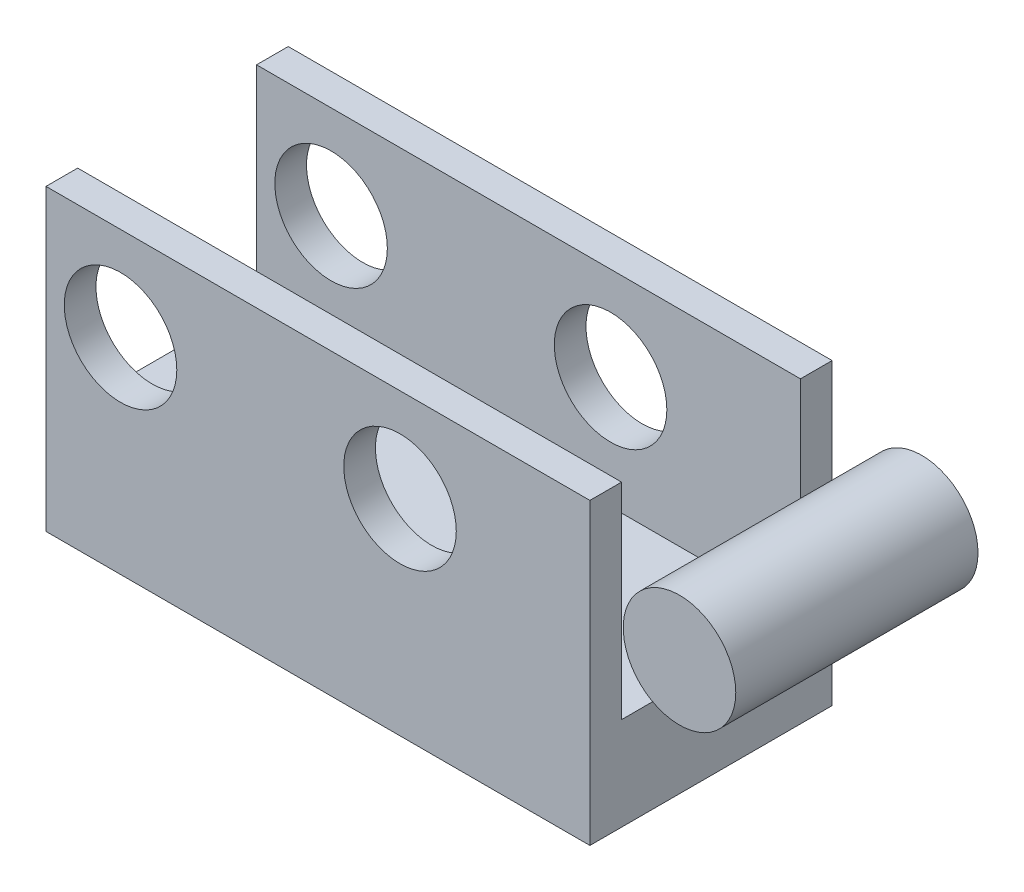
ISO-10303-21;
HEADER;
FILE_DESCRIPTION(('STEP AP214'),'2;1');
FILE_NAME('part.step','',(''),(''),'','','');
FILE_SCHEMA(('AUTOMOTIVE_DESIGN { 1 0 10303 214 1 1 1 1 }'));
ENDSEC;
DATA;
#1=APPLICATION_CONTEXT('core data for automotive mechanical design processes');
#2=APPLICATION_PROTOCOL_DEFINITION('international standard','automotive_design',2000,#1);
#3=PRODUCT_CONTEXT('',#1,'mechanical');
#4=PRODUCT('Part','Part','',(#3));
#5=PRODUCT_RELATED_PRODUCT_CATEGORY('part','',(#4));
#6=PRODUCT_DEFINITION_FORMATION('','',#4);
#7=PRODUCT_DEFINITION_CONTEXT('part definition',#1,'design');
#8=PRODUCT_DEFINITION('design','',#6,#7);
#9=PRODUCT_DEFINITION_SHAPE('','',#8);
#10=(LENGTH_UNIT() NAMED_UNIT(*) SI_UNIT(.MILLI.,.METRE.));
#11=(NAMED_UNIT(*) PLANE_ANGLE_UNIT() SI_UNIT($,.RADIAN.));
#12=(NAMED_UNIT(*) SI_UNIT($,.STERADIAN.) SOLID_ANGLE_UNIT());
#13=UNCERTAINTY_MEASURE_WITH_UNIT(LENGTH_MEASURE(1.E-05),#10,'distance_accuracy_value','');
#14=(GEOMETRIC_REPRESENTATION_CONTEXT(3) GLOBAL_UNCERTAINTY_ASSIGNED_CONTEXT((#13)) GLOBAL_UNIT_ASSIGNED_CONTEXT((#10,
#11,#12)) REPRESENTATION_CONTEXT('',''));
#15=CARTESIAN_POINT('',(0.,0.,0.));
#16=DIRECTION('',(0.,0.,1.));
#17=DIRECTION('',(1.,0.,0.));
#18=AXIS2_PLACEMENT_3D('',#15,#16,#17);
#19=CARTESIAN_POINT('',(9.70218830460323,-2.14074725353277,3.25));
#20=DIRECTION('',(0.,0.,-1.));
#21=DIRECTION('',(-1.,0.,0.));
#22=AXIS2_PLACEMENT_3D('',#19,#20,#21);
#23=CYLINDRICAL_SURFACE('',#22,1.50999999999898);
#24=CARTESIAN_POINT('',(9.70218830460323,-2.14074725353277,3.25));
#25=DIRECTION('',(0.,0.,1.));
#26=DIRECTION('',(1.,0.,0.));
#27=AXIS2_PLACEMENT_3D('',#24,#25,#26);
#28=CIRCLE('',#27,1.50999999999898);
#29=CARTESIAN_POINT('',(11.2121883046022,-2.14074725353277,3.25));
#30=VERTEX_POINT('',#29);
#31=EDGE_CURVE('E11',#30,#30,#28,.T.);
#32=ORIENTED_EDGE('',*,*,#31,.F.);
#33=EDGE_LOOP('',(#32));
#34=FACE_BOUND('',#33,.T.);
#35=CARTESIAN_POINT('',(9.70218830460323,-2.14074725353277,-3.25));
#36=DIRECTION('',(0.,0.,1.));
#37=DIRECTION('',(1.,0.,0.));
#38=AXIS2_PLACEMENT_3D('',#35,#36,#37);
#39=CIRCLE('',#38,1.50999999999898);
#40=CARTESIAN_POINT('',(11.2121883046022,-2.14074725353277,-3.25));
#41=VERTEX_POINT('',#40);
#42=EDGE_CURVE('E48',#41,#41,#39,.T.);
#43=ORIENTED_EDGE('',*,*,#42,.T.);
#44=EDGE_LOOP('',(#43));
#45=FACE_BOUND('',#44,.T.);
#46=ADVANCED_FACE('F45',(#34,#45),#23,.T.);
#47=CARTESIAN_POINT('',(9.70218830460323,-2.14074725353277,3.25));
#48=DIRECTION('',(0.,0.,1.));
#49=DIRECTION('',(1.,0.,0.));
#50=AXIS2_PLACEMENT_3D('',#47,#48,#49);
#51=PLANE('',#50);
#52=ORIENTED_EDGE('',*,*,#31,.T.);
#53=EDGE_LOOP('',(#52));
#54=FACE_BOUND('',#53,.T.);
#55=ADVANCED_FACE('F60',(#54),#51,.T.);
#56=CARTESIAN_POINT('',(9.70218830460323,-2.14074725353277,-3.25));
#57=DIRECTION('',(0.,0.,1.));
#58=DIRECTION('',(1.,0.,0.));
#59=AXIS2_PLACEMENT_3D('',#56,#57,#58);
#60=PLANE('',#59);
#61=ORIENTED_EDGE('',*,*,#42,.F.);
#62=EDGE_LOOP('',(#61));
#63=FACE_BOUND('',#62,.T.);
#64=ADVANCED_FACE('F58',(#63),#60,.F.);
#65=CLOSED_SHELL('',(#46,#55,#64));
#66=MANIFOLD_SOLID_BREP('B2',#65);
#67=CARTESIAN_POINT('',(-7.29781169539677,0.369252746467232,3.25));
#68=DIRECTION('',(1.,0.,0.));
#69=DIRECTION('',(0.,1.,0.));
#70=AXIS2_PLACEMENT_3D('',#67,#68,#69);
#71=PLANE('',#70);
#72=DIRECTION('',(0.,-1.,0.));
#73=VECTOR('',#72,1.);
#74=CARTESIAN_POINT('',(-7.29781169539677,0.369252746467232,-2.4));
#75=LINE('',#74,#73);
#76=CARTESIAN_POINT('',(-7.29781169539677,0.369252746467232,-2.4));
#77=VERTEX_POINT('',#76);
#78=CARTESIAN_POINT('',(-7.29781169539677,-5.15074725353277,-2.4));
#79=VERTEX_POINT('',#78);
#80=EDGE_CURVE('E173',#77,#79,#75,.T.);
#81=ORIENTED_EDGE('',*,*,#80,.F.);
#82=DIRECTION('',(0.,0.,-1.));
#83=VECTOR('',#82,1.);
#84=CARTESIAN_POINT('',(-7.29781169539677,0.369252746467232,3.25));
#85=LINE('',#84,#83);
#86=CARTESIAN_POINT('',(-7.29781169539677,0.369252746467232,-3.25));
#87=VERTEX_POINT('',#86);
#88=EDGE_CURVE('E133',#77,#87,#85,.T.);
#89=ORIENTED_EDGE('',*,*,#88,.T.);
#90=DIRECTION('',(0.,-1.,0.));
#91=VECTOR('',#90,1.);
#92=CARTESIAN_POINT('',(-7.29781169539677,0.369252746467232,-3.25));
#93=LINE('',#92,#91);
#94=CARTESIAN_POINT('',(-7.29781169539677,-7.65074725353277,-3.25));
#95=VERTEX_POINT('',#94);
#96=EDGE_CURVE('E203',#87,#95,#93,.T.);
#97=ORIENTED_EDGE('',*,*,#96,.T.);
#98=DIRECTION('',(0.,0.,-1.));
#99=VECTOR('',#98,1.);
#100=CARTESIAN_POINT('',(-7.29781169539677,-7.65074725353277,3.25));
#101=LINE('',#100,#99);
#102=CARTESIAN_POINT('',(-7.29781169539677,-7.65074725353277,3.25));
#103=VERTEX_POINT('',#102);
#104=EDGE_CURVE('E43',#103,#95,#101,.T.);
#105=ORIENTED_EDGE('',*,*,#104,.F.);
#106=DIRECTION('',(0.,-1.,0.));
#107=VECTOR('',#106,1.);
#108=CARTESIAN_POINT('',(-7.29781169539677,0.369252746467232,3.25));
#109=LINE('',#108,#107);
#110=CARTESIAN_POINT('',(-7.29781169539677,0.369252746467232,3.25));
#111=VERTEX_POINT('',#110);
#112=EDGE_CURVE('E206',#111,#103,#109,.T.);
#113=ORIENTED_EDGE('',*,*,#112,.F.);
#114=CARTESIAN_POINT('',(-7.29781169539677,0.369252746467232,2.4));
#115=VERTEX_POINT('',#114);
#116=EDGE_CURVE('E220',#111,#115,#85,.T.);
#117=ORIENTED_EDGE('',*,*,#116,.T.);
#118=DIRECTION('',(0.,-1.,0.));
#119=VECTOR('',#118,1.);
#120=CARTESIAN_POINT('',(-7.29781169539677,0.369252746467232,2.4));
#121=LINE('',#120,#119);
#122=CARTESIAN_POINT('',(-7.29781169539677,-5.15074725353277,2.4));
#123=VERTEX_POINT('',#122);
#124=EDGE_CURVE('E102',#115,#123,#121,.T.);
#125=ORIENTED_EDGE('',*,*,#124,.T.);
#126=DIRECTION('',(0.,0.,1.));
#127=VECTOR('',#126,1.);
#128=CARTESIAN_POINT('',(-7.29781169539677,-5.15074725353277,-2.4));
#129=LINE('',#128,#127);
#130=EDGE_CURVE('E167',#79,#123,#129,.T.);
#131=ORIENTED_EDGE('',*,*,#130,.F.);
#132=EDGE_LOOP('',(#81,#89,#97,#105,#113,#117,#125,#131));
#133=FACE_BOUND('',#132,.T.);
#134=ADVANCED_FACE('F86',(#133),#71,.F.);
#135=CARTESIAN_POINT('',(7.29781169539677,0.369252746467232,3.25));
#136=DIRECTION('',(-1.,0.,0.));
#137=DIRECTION('',(0.,-1.,0.));
#138=AXIS2_PLACEMENT_3D('',#135,#136,#137);
#139=PLANE('',#138);
#140=DIRECTION('',(0.,1.,0.));
#141=VECTOR('',#140,1.);
#142=CARTESIAN_POINT('',(7.29781169539677,0.369252746467232,-2.4));
#143=LINE('',#142,#141);
#144=CARTESIAN_POINT('',(7.29781169539677,-5.15074725353277,-2.4));
#145=VERTEX_POINT('',#144);
#146=CARTESIAN_POINT('',(7.29781169539677,0.369252746467232,-2.4));
#147=VERTEX_POINT('',#146);
#148=EDGE_CURVE('E172',#145,#147,#143,.T.);
#149=ORIENTED_EDGE('',*,*,#148,.F.);
#150=DIRECTION('',(0.,0.,1.));
#151=VECTOR('',#150,1.);
#152=CARTESIAN_POINT('',(7.29781169539677,-5.15074725353277,-2.4));
#153=LINE('',#152,#151);
#154=CARTESIAN_POINT('',(7.29781169539677,-5.15074725353277,2.4));
#155=VERTEX_POINT('',#154);
#156=EDGE_CURVE('E169',#145,#155,#153,.T.);
#157=ORIENTED_EDGE('',*,*,#156,.T.);
#158=DIRECTION('',(0.,1.,0.));
#159=VECTOR('',#158,1.);
#160=CARTESIAN_POINT('',(7.29781169539677,0.369252746467232,2.4));
#161=LINE('',#160,#159);
#162=CARTESIAN_POINT('',(7.29781169539677,0.369252746467232,2.4));
#163=VERTEX_POINT('',#162);
#164=EDGE_CURVE('E289',#155,#163,#161,.T.);
#165=ORIENTED_EDGE('',*,*,#164,.T.);
#166=DIRECTION('',(0.,0.,-1.));
#167=VECTOR('',#166,1.);
#168=CARTESIAN_POINT('',(7.29781169539677,0.369252746467232,3.25));
#169=LINE('',#168,#167);
#170=CARTESIAN_POINT('',(7.29781169539677,0.369252746467232,3.25));
#171=VERTEX_POINT('',#170);
#172=EDGE_CURVE('E223',#171,#163,#169,.T.);
#173=ORIENTED_EDGE('',*,*,#172,.F.);
#174=DIRECTION('',(0.,1.,0.));
#175=VECTOR('',#174,1.);
#176=CARTESIAN_POINT('',(7.29781169539677,0.369252746467232,3.25));
#177=LINE('',#176,#175);
#178=CARTESIAN_POINT('',(7.29781169539677,-7.65074725353277,3.25));
#179=VERTEX_POINT('',#178);
#180=EDGE_CURVE('E210',#179,#171,#177,.T.);
#181=ORIENTED_EDGE('',*,*,#180,.F.);
#182=DIRECTION('',(0.,0.,-1.));
#183=VECTOR('',#182,1.);
#184=CARTESIAN_POINT('',(7.29781169539677,-7.65074725353277,3.25));
#185=LINE('',#184,#183);
#186=CARTESIAN_POINT('',(7.29781169539677,-7.65074725353277,-3.25));
#187=VERTEX_POINT('',#186);
#188=EDGE_CURVE('E94',#179,#187,#185,.T.);
#189=ORIENTED_EDGE('',*,*,#188,.T.);
#190=DIRECTION('',(0.,1.,0.));
#191=VECTOR('',#190,1.);
#192=CARTESIAN_POINT('',(7.29781169539677,0.369252746467232,-3.25));
#193=LINE('',#192,#191);
#194=CARTESIAN_POINT('',(7.29781169539677,0.369252746467232,-3.25));
#195=VERTEX_POINT('',#194);
#196=EDGE_CURVE('E216',#187,#195,#193,.T.);
#197=ORIENTED_EDGE('',*,*,#196,.T.);
#198=EDGE_CURVE('E222',#147,#195,#169,.T.);
#199=ORIENTED_EDGE('',*,*,#198,.F.);
#200=EDGE_LOOP('',(#149,#157,#165,#173,#181,#189,#197,#199));
#201=FACE_BOUND('',#200,.T.);
#202=ADVANCED_FACE('F257',(#201),#139,.F.);
#203=CARTESIAN_POINT('',(-7.29781169539677,0.369252746467232,3.25));
#204=DIRECTION('',(0.,-1.,0.));
#205=DIRECTION('',(0.,0.,-1.));
#206=AXIS2_PLACEMENT_3D('',#203,#204,#205);
#207=PLANE('',#206);
#208=DIRECTION('',(-1.,0.,0.));
#209=VECTOR('',#208,1.);
#210=CARTESIAN_POINT('',(-7.29781169539677,0.369252746467232,-2.4));
#211=LINE('',#210,#209);
#212=EDGE_CURVE('E177',#147,#77,#211,.T.);
#213=ORIENTED_EDGE('',*,*,#212,.F.);
#214=ORIENTED_EDGE('',*,*,#198,.T.);
#215=DIRECTION('',(-1.,0.,0.));
#216=VECTOR('',#215,1.);
#217=CARTESIAN_POINT('',(-7.29781169539677,0.369252746467232,-3.25));
#218=LINE('',#217,#216);
#219=EDGE_CURVE('E208',#195,#87,#218,.T.);
#220=ORIENTED_EDGE('',*,*,#219,.T.);
#221=ORIENTED_EDGE('',*,*,#88,.F.);
#222=EDGE_LOOP('',(#213,#214,#220,#221));
#223=FACE_BOUND('',#222,.T.);
#224=ADVANCED_FACE('F261',(#223),#207,.F.);
#225=CARTESIAN_POINT('',(2.20218830460323,-2.14074725353277,3.25));
#226=DIRECTION('',(0.,0.,-1.));
#227=DIRECTION('',(-1.,0.,0.));
#228=AXIS2_PLACEMENT_3D('',#225,#226,#227);
#229=CYLINDRICAL_SURFACE('',#228,1.50999999999898);
#230=CARTESIAN_POINT('',(2.20218830460323,-2.14074725353277,-3.25));
#231=DIRECTION('',(0.,0.,1.));
#232=DIRECTION('',(1.,0.,0.));
#233=AXIS2_PLACEMENT_3D('',#230,#231,#232);
#234=CIRCLE('',#233,1.50999999999898);
#235=CARTESIAN_POINT('',(3.71218830460221,-2.14074725353277,-3.25));
#236=VERTEX_POINT('',#235);
#237=EDGE_CURVE('E197',#236,#236,#234,.T.);
#238=ORIENTED_EDGE('',*,*,#237,.F.);
#239=EDGE_LOOP('',(#238));
#240=FACE_BOUND('',#239,.T.);
#241=CARTESIAN_POINT('',(2.20218830460323,-2.14074725353277,-2.4));
#242=DIRECTION('',(0.,0.,1.));
#243=DIRECTION('',(1.,0.,0.));
#244=AXIS2_PLACEMENT_3D('',#241,#242,#243);
#245=CIRCLE('',#244,1.50999999999898);
#246=CARTESIAN_POINT('',(3.71218830460221,-2.14074725353277,-2.4));
#247=VERTEX_POINT('',#246);
#248=EDGE_CURVE('E190',#247,#247,#245,.T.);
#249=ORIENTED_EDGE('',*,*,#248,.T.);
#250=EDGE_LOOP('',(#249));
#251=FACE_BOUND('',#250,.T.);
#252=ADVANCED_FACE('F252',(#240,#251),#229,.F.);
#253=CARTESIAN_POINT('',(-5.29781169539677,-2.14074725353277,3.25));
#254=DIRECTION('',(0.,0.,-1.));
#255=DIRECTION('',(-1.,0.,0.));
#256=AXIS2_PLACEMENT_3D('',#253,#254,#255);
#257=CYLINDRICAL_SURFACE('',#256,1.50999999999898);
#258=CARTESIAN_POINT('',(-5.29781169539677,-2.14074725353277,-3.25));
#259=DIRECTION('',(0.,0.,1.));
#260=DIRECTION('',(1.,0.,0.));
#261=AXIS2_PLACEMENT_3D('',#258,#259,#260);
#262=CIRCLE('',#261,1.50999999999898);
#263=CARTESIAN_POINT('',(-3.78781169539779,-2.14074725353277,-3.25));
#264=VERTEX_POINT('',#263);
#265=EDGE_CURVE('E193',#264,#264,#262,.T.);
#266=ORIENTED_EDGE('',*,*,#265,.F.);
#267=EDGE_LOOP('',(#266));
#268=FACE_BOUND('',#267,.T.);
#269=CARTESIAN_POINT('',(-5.29781169539677,-2.14074725353277,-2.4));
#270=DIRECTION('',(0.,0.,1.));
#271=DIRECTION('',(1.,0.,0.));
#272=AXIS2_PLACEMENT_3D('',#269,#270,#271);
#273=CIRCLE('',#272,1.50999999999898);
#274=CARTESIAN_POINT('',(-3.78781169539779,-2.14074725353277,-2.4));
#275=VERTEX_POINT('',#274);
#276=EDGE_CURVE('E89',#275,#275,#273,.T.);
#277=ORIENTED_EDGE('',*,*,#276,.T.);
#278=EDGE_LOOP('',(#277));
#279=FACE_BOUND('',#278,.T.);
#280=ADVANCED_FACE('F237',(#268,#279),#257,.F.);
#281=CARTESIAN_POINT('',(0.,0.,3.25));
#282=DIRECTION('',(0.,0.,1.));
#283=DIRECTION('',(1.,0.,0.));
#284=AXIS2_PLACEMENT_3D('',#281,#282,#283);
#285=PLANE('',#284);
#286=CARTESIAN_POINT('',(2.20218830460323,-2.14074725353277,3.25));
#287=DIRECTION('',(0.,0.,1.));
#288=DIRECTION('',(1.,0.,0.));
#289=AXIS2_PLACEMENT_3D('',#286,#287,#288);
#290=CIRCLE('',#289,1.50999999999898);
#291=CARTESIAN_POINT('',(3.71218830460221,-2.14074725353277,3.25));
#292=VERTEX_POINT('',#291);
#293=EDGE_CURVE('E200',#292,#292,#290,.T.);
#294=ORIENTED_EDGE('',*,*,#293,.F.);
#295=EDGE_LOOP('',(#294));
#296=FACE_BOUND('',#295,.T.);
#297=ORIENTED_EDGE('',*,*,#112,.T.);
#298=DIRECTION('',(1.,0.,0.));
#299=VECTOR('',#298,1.);
#300=CARTESIAN_POINT('',(-7.29781169539677,-7.65074725353277,3.25));
#301=LINE('',#300,#299);
#302=EDGE_CURVE('E140',#103,#179,#301,.T.);
#303=ORIENTED_EDGE('',*,*,#302,.T.);
#304=ORIENTED_EDGE('',*,*,#180,.T.);
#305=DIRECTION('',(-1.,0.,0.));
#306=VECTOR('',#305,1.);
#307=CARTESIAN_POINT('',(-7.29781169539677,0.369252746467232,3.25));
#308=LINE('',#307,#306);
#309=EDGE_CURVE('E111',#171,#111,#308,.T.);
#310=ORIENTED_EDGE('',*,*,#309,.T.);
#311=EDGE_LOOP('',(#297,#303,#304,#310));
#312=FACE_BOUND('',#311,.T.);
#313=CARTESIAN_POINT('',(-5.29781169539677,-2.14074725353277,3.25));
#314=DIRECTION('',(0.,0.,1.));
#315=DIRECTION('',(1.,0.,0.));
#316=AXIS2_PLACEMENT_3D('',#313,#314,#315);
#317=CIRCLE('',#316,1.50999999999898);
#318=CARTESIAN_POINT('',(-3.78781169539779,-2.14074725353277,3.25));
#319=VERTEX_POINT('',#318);
#320=EDGE_CURVE('E194',#319,#319,#317,.T.);
#321=ORIENTED_EDGE('',*,*,#320,.F.);
#322=EDGE_LOOP('',(#321));
#323=FACE_BOUND('',#322,.T.);
#324=ADVANCED_FACE('F240',(#296,#312,#323),#285,.T.);
#325=CARTESIAN_POINT('',(0.,0.,-3.25));
#326=DIRECTION('',(0.,0.,1.));
#327=DIRECTION('',(1.,0.,0.));
#328=AXIS2_PLACEMENT_3D('',#325,#326,#327);
#329=PLANE('',#328);
#330=ORIENTED_EDGE('',*,*,#96,.F.);
#331=ORIENTED_EDGE('',*,*,#219,.F.);
#332=ORIENTED_EDGE('',*,*,#196,.F.);
#333=DIRECTION('',(1.,0.,0.));
#334=VECTOR('',#333,1.);
#335=CARTESIAN_POINT('',(-7.29781169539677,-7.65074725353277,-3.25));
#336=LINE('',#335,#334);
#337=EDGE_CURVE('E214',#95,#187,#336,.T.);
#338=ORIENTED_EDGE('',*,*,#337,.F.);
#339=EDGE_LOOP('',(#330,#331,#332,#338));
#340=FACE_BOUND('',#339,.T.);
#341=ORIENTED_EDGE('',*,*,#237,.T.);
#342=EDGE_LOOP('',(#341));
#343=FACE_BOUND('',#342,.T.);
#344=ORIENTED_EDGE('',*,*,#265,.T.);
#345=EDGE_LOOP('',(#344));
#346=FACE_BOUND('',#345,.T.);
#347=ADVANCED_FACE('F242',(#340,#343,#346),#329,.F.);
#348=CARTESIAN_POINT('',(-7.29781169539677,-7.65074725353277,3.25));
#349=DIRECTION('',(0.,1.,0.));
#350=DIRECTION('',(0.,0.,1.));
#351=AXIS2_PLACEMENT_3D('',#348,#349,#350);
#352=PLANE('',#351);
#353=ORIENTED_EDGE('',*,*,#337,.T.);
#354=ORIENTED_EDGE('',*,*,#188,.F.);
#355=ORIENTED_EDGE('',*,*,#302,.F.);
#356=ORIENTED_EDGE('',*,*,#104,.T.);
#357=EDGE_LOOP('',(#353,#354,#355,#356));
#358=FACE_BOUND('',#357,.T.);
#359=ADVANCED_FACE('F249',(#358),#352,.F.);
#360=ORIENTED_EDGE('',*,*,#172,.T.);
#361=DIRECTION('',(-1.,0.,0.));
#362=VECTOR('',#361,1.);
#363=CARTESIAN_POINT('',(-7.29781169539677,0.369252746467232,2.4));
#364=LINE('',#363,#362);
#365=EDGE_CURVE('E178',#163,#115,#364,.T.);
#366=ORIENTED_EDGE('',*,*,#365,.T.);
#367=ORIENTED_EDGE('',*,*,#116,.F.);
#368=ORIENTED_EDGE('',*,*,#309,.F.);
#369=EDGE_LOOP('',(#360,#366,#367,#368));
#370=FACE_BOUND('',#369,.T.);
#371=ADVANCED_FACE('F269',(#370),#207,.F.);
#372=CARTESIAN_POINT('',(2.20218830460323,-2.14074725353277,2.4));
#373=DIRECTION('',(0.,0.,1.));
#374=DIRECTION('',(1.,0.,0.));
#375=AXIS2_PLACEMENT_3D('',#372,#373,#374);
#376=CIRCLE('',#375,1.50999999999898);
#377=CARTESIAN_POINT('',(3.71218830460221,-2.14074725353277,2.4));
#378=VERTEX_POINT('',#377);
#379=EDGE_CURVE('E187',#378,#378,#376,.T.);
#380=ORIENTED_EDGE('',*,*,#379,.F.);
#381=EDGE_LOOP('',(#380));
#382=FACE_BOUND('',#381,.T.);
#383=ORIENTED_EDGE('',*,*,#293,.T.);
#384=EDGE_LOOP('',(#383));
#385=FACE_BOUND('',#384,.T.);
#386=ADVANCED_FACE('F235',(#382,#385),#229,.F.);
#387=CARTESIAN_POINT('',(-5.29781169539677,-2.14074725353277,2.4));
#388=DIRECTION('',(0.,0.,1.));
#389=DIRECTION('',(1.,0.,0.));
#390=AXIS2_PLACEMENT_3D('',#387,#388,#389);
#391=CIRCLE('',#390,1.50999999999898);
#392=CARTESIAN_POINT('',(-3.78781169539779,-2.14074725353277,2.4));
#393=VERTEX_POINT('',#392);
#394=EDGE_CURVE('E182',#393,#393,#391,.T.);
#395=ORIENTED_EDGE('',*,*,#394,.F.);
#396=EDGE_LOOP('',(#395));
#397=FACE_BOUND('',#396,.T.);
#398=ORIENTED_EDGE('',*,*,#320,.T.);
#399=EDGE_LOOP('',(#398));
#400=FACE_BOUND('',#399,.T.);
#401=ADVANCED_FACE('F232',(#397,#400),#257,.F.);
#402=CARTESIAN_POINT('',(-7.29781169539677,-5.15074725353277,-2.4));
#403=DIRECTION('',(0.,-1.,0.));
#404=DIRECTION('',(0.,0.,-1.));
#405=AXIS2_PLACEMENT_3D('',#402,#403,#404);
#406=PLANE('',#405);
#407=DIRECTION('',(1.,0.,0.));
#408=VECTOR('',#407,1.);
#409=CARTESIAN_POINT('',(-7.29781169539677,-5.15074725353277,2.4));
#410=LINE('',#409,#408);
#411=EDGE_CURVE('E287',#123,#155,#410,.T.);
#412=ORIENTED_EDGE('',*,*,#411,.T.);
#413=ORIENTED_EDGE('',*,*,#156,.F.);
#414=DIRECTION('',(1.,0.,0.));
#415=VECTOR('',#414,1.);
#416=CARTESIAN_POINT('',(-7.29781169539677,-5.15074725353277,-2.4));
#417=LINE('',#416,#415);
#418=EDGE_CURVE('E162',#79,#145,#417,.T.);
#419=ORIENTED_EDGE('',*,*,#418,.F.);
#420=ORIENTED_EDGE('',*,*,#130,.T.);
#421=EDGE_LOOP('',(#412,#413,#419,#420));
#422=FACE_BOUND('',#421,.T.);
#423=ADVANCED_FACE('F165',(#422),#406,.F.);
#424=CARTESIAN_POINT('',(0.,0.,-2.4));
#425=DIRECTION('',(0.,0.,1.));
#426=DIRECTION('',(1.,0.,0.));
#427=AXIS2_PLACEMENT_3D('',#424,#425,#426);
#428=PLANE('',#427);
#429=ORIENTED_EDGE('',*,*,#248,.F.);
#430=EDGE_LOOP('',(#429));
#431=FACE_BOUND('',#430,.T.);
#432=ORIENTED_EDGE('',*,*,#276,.F.);
#433=EDGE_LOOP('',(#432));
#434=FACE_BOUND('',#433,.T.);
#435=ORIENTED_EDGE('',*,*,#80,.T.);
#436=ORIENTED_EDGE('',*,*,#418,.T.);
#437=ORIENTED_EDGE('',*,*,#148,.T.);
#438=ORIENTED_EDGE('',*,*,#212,.T.);
#439=EDGE_LOOP('',(#435,#436,#437,#438));
#440=FACE_BOUND('',#439,.T.);
#441=ADVANCED_FACE('F175',(#431,#434,#440),#428,.T.);
#442=CARTESIAN_POINT('',(0.,0.,2.4));
#443=DIRECTION('',(0.,0.,1.));
#444=DIRECTION('',(1.,0.,0.));
#445=AXIS2_PLACEMENT_3D('',#442,#443,#444);
#446=PLANE('',#445);
#447=ORIENTED_EDGE('',*,*,#379,.T.);
#448=EDGE_LOOP('',(#447));
#449=FACE_BOUND('',#448,.T.);
#450=ORIENTED_EDGE('',*,*,#394,.T.);
#451=EDGE_LOOP('',(#450));
#452=FACE_BOUND('',#451,.T.);
#453=ORIENTED_EDGE('',*,*,#124,.F.);
#454=ORIENTED_EDGE('',*,*,#365,.F.);
#455=ORIENTED_EDGE('',*,*,#164,.F.);
#456=ORIENTED_EDGE('',*,*,#411,.F.);
#457=EDGE_LOOP('',(#453,#454,#455,#456));
#458=FACE_BOUND('',#457,.T.);
#459=ADVANCED_FACE('F230',(#449,#452,#458),#446,.F.);
#460=CLOSED_SHELL('',(#134,#202,#224,#252,#280,#324,#347,#359,#371,#386,#401,#423,#441,#459));
#461=MANIFOLD_SOLID_BREP('B6',#460);
#462=ADVANCED_BREP_SHAPE_REPRESENTATION('',(#18,#66,#461),#14);
#463=SHAPE_DEFINITION_REPRESENTATION(#9,#462);
ENDSEC;
END-ISO-10303-21;
